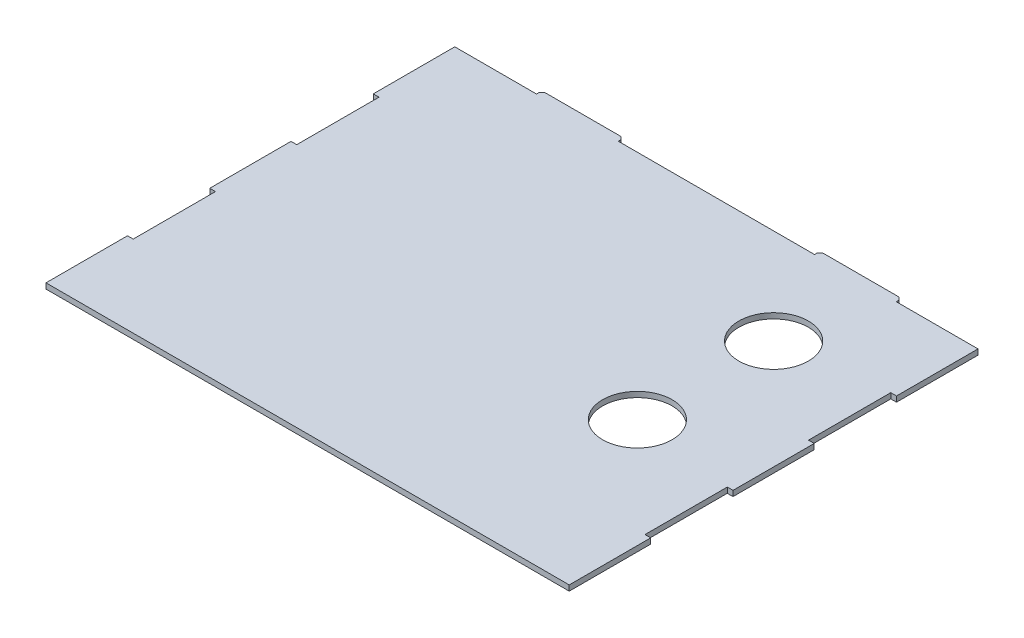
ISO-10303-21;
HEADER;
FILE_DESCRIPTION(('STEP AP214'),'2;1');
FILE_NAME('part.step','',(''),(''),'','','');
FILE_SCHEMA(('AUTOMOTIVE_DESIGN { 1 0 10303 214 1 1 1 1 }'));
ENDSEC;
DATA;
#1=APPLICATION_CONTEXT('core data for automotive mechanical design processes');
#2=APPLICATION_PROTOCOL_DEFINITION('international standard','automotive_design',2000,#1);
#3=PRODUCT_CONTEXT('',#1,'mechanical');
#4=PRODUCT('Part','Part','',(#3));
#5=PRODUCT_RELATED_PRODUCT_CATEGORY('part','',(#4));
#6=PRODUCT_DEFINITION_FORMATION('','',#4);
#7=PRODUCT_DEFINITION_CONTEXT('part definition',#1,'design');
#8=PRODUCT_DEFINITION('design','',#6,#7);
#9=PRODUCT_DEFINITION_SHAPE('','',#8);
#10=(LENGTH_UNIT() NAMED_UNIT(*) SI_UNIT(.MILLI.,.METRE.));
#11=(NAMED_UNIT(*) PLANE_ANGLE_UNIT() SI_UNIT($,.RADIAN.));
#12=(NAMED_UNIT(*) SI_UNIT($,.STERADIAN.) SOLID_ANGLE_UNIT());
#13=UNCERTAINTY_MEASURE_WITH_UNIT(LENGTH_MEASURE(1.E-05),#10,'distance_accuracy_value','');
#14=(GEOMETRIC_REPRESENTATION_CONTEXT(3) GLOBAL_UNCERTAINTY_ASSIGNED_CONTEXT((#13)) GLOBAL_UNIT_ASSIGNED_CONTEXT((#10,
#11,#12)) REPRESENTATION_CONTEXT('',''));
#15=CARTESIAN_POINT('',(0.,0.,0.));
#16=DIRECTION('',(0.,0.,1.));
#17=DIRECTION('',(1.,0.,0.));
#18=AXIS2_PLACEMENT_3D('',#15,#16,#17);
#19=CARTESIAN_POINT('',(-96.,-2.,75.));
#20=DIRECTION('',(-1.,0.,0.));
#21=DIRECTION('',(0.,0.,1.));
#22=AXIS2_PLACEMENT_3D('',#19,#20,#21);
#23=PLANE('',#22);
#24=DIRECTION('',(0.,-1.,0.));
#25=VECTOR('',#24,1.);
#26=CARTESIAN_POINT('',(-96.,-2.00000000000001,-45.1000000000001));
#27=LINE('',#26,#25);
#28=CARTESIAN_POINT('',(-96.,0.,-45.1000000000001));
#29=VERTEX_POINT('',#28);
#30=CARTESIAN_POINT('',(-96.,-2.00000000000004,-45.1000000000001));
#31=VERTEX_POINT('',#30);
#32=EDGE_CURVE('E281',#29,#31,#27,.T.);
#33=ORIENTED_EDGE('',*,*,#32,.F.);
#34=DIRECTION('',(0.,0.,1.));
#35=VECTOR('',#34,1.);
#36=CARTESIAN_POINT('',(-96.,0.,75.));
#37=LINE('',#36,#35);
#38=CARTESIAN_POINT('',(-96.,0.,-75.));
#39=VERTEX_POINT('',#38);
#40=EDGE_CURVE('E559',#39,#29,#37,.T.);
#41=ORIENTED_EDGE('',*,*,#40,.F.);
#42=DIRECTION('',(0.,1.,0.));
#43=VECTOR('',#42,1.);
#44=CARTESIAN_POINT('',(-96.,-2.,-75.));
#45=LINE('',#44,#43);
#46=CARTESIAN_POINT('',(-96.,-2.,-75.));
#47=VERTEX_POINT('',#46);
#48=EDGE_CURVE('E572',#47,#39,#45,.T.);
#49=ORIENTED_EDGE('',*,*,#48,.F.);
#50=DIRECTION('',(0.,0.,1.));
#51=VECTOR('',#50,1.);
#52=CARTESIAN_POINT('',(-96.,-2.,75.));
#53=LINE('',#52,#51);
#54=EDGE_CURVE('E542',#47,#31,#53,.T.);
#55=ORIENTED_EDGE('',*,*,#54,.T.);
#56=EDGE_LOOP('',(#33,#41,#49,#55));
#57=FACE_BOUND('',#56,.T.);
#58=ADVANCED_FACE('F68',(#57),#23,.T.);
#59=DIRECTION('',(0.,1.,0.));
#60=VECTOR('',#59,1.);
#61=CARTESIAN_POINT('',(-96.,-2.00000000000001,-14.9000000000001));
#62=LINE('',#61,#60);
#63=CARTESIAN_POINT('',(-96.,-2.00000000000004,-14.9));
#64=VERTEX_POINT('',#63);
#65=CARTESIAN_POINT('',(-96.,0.,-14.9000000000001));
#66=VERTEX_POINT('',#65);
#67=EDGE_CURVE('E91',#64,#66,#62,.T.);
#68=ORIENTED_EDGE('',*,*,#67,.F.);
#69=CARTESIAN_POINT('',(-96.,-2.00000000000004,14.9));
#70=VERTEX_POINT('',#69);
#71=EDGE_CURVE('E545',#64,#70,#53,.T.);
#72=ORIENTED_EDGE('',*,*,#71,.T.);
#73=DIRECTION('',(0.,-1.,0.));
#74=VECTOR('',#73,1.);
#75=CARTESIAN_POINT('',(-96.,-2.00000000000001,14.9));
#76=LINE('',#75,#74);
#77=CARTESIAN_POINT('',(-96.,0.,14.9));
#78=VERTEX_POINT('',#77);
#79=EDGE_CURVE('E341',#78,#70,#76,.T.);
#80=ORIENTED_EDGE('',*,*,#79,.F.);
#81=EDGE_CURVE('E563',#66,#78,#37,.T.);
#82=ORIENTED_EDGE('',*,*,#81,.F.);
#83=EDGE_LOOP('',(#68,#72,#80,#82));
#84=FACE_BOUND('',#83,.T.);
#85=ADVANCED_FACE('F597',(#84),#23,.T.);
#86=CARTESIAN_POINT('',(96.,-2.,75.));
#87=DIRECTION('',(1.,0.,0.));
#88=DIRECTION('',(0.,0.,-1.));
#89=AXIS2_PLACEMENT_3D('',#86,#87,#88);
#90=PLANE('',#89);
#91=DIRECTION('',(0.,-1.,0.));
#92=VECTOR('',#91,1.);
#93=CARTESIAN_POINT('',(96.,-2.,-14.9000000000001));
#94=LINE('',#93,#92);
#95=CARTESIAN_POINT('',(96.,0.,-14.9000000000001));
#96=VERTEX_POINT('',#95);
#97=CARTESIAN_POINT('',(96.,-2.00000000000003,-14.9000000000001));
#98=VERTEX_POINT('',#97);
#99=EDGE_CURVE('E413',#96,#98,#94,.T.);
#100=ORIENTED_EDGE('',*,*,#99,.F.);
#101=DIRECTION('',(0.,0.,-1.));
#102=VECTOR('',#101,1.);
#103=CARTESIAN_POINT('',(96.,0.,75.));
#104=LINE('',#103,#102);
#105=CARTESIAN_POINT('',(96.,0.,14.8999999999999));
#106=VERTEX_POINT('',#105);
#107=EDGE_CURVE('E553',#106,#96,#104,.T.);
#108=ORIENTED_EDGE('',*,*,#107,.F.);
#109=DIRECTION('',(0.,1.,0.));
#110=VECTOR('',#109,1.);
#111=CARTESIAN_POINT('',(96.,-2.,14.8999999999999));
#112=LINE('',#111,#110);
#113=CARTESIAN_POINT('',(96.,-2.00000000000003,14.8999999999999));
#114=VERTEX_POINT('',#113);
#115=EDGE_CURVE('E378',#114,#106,#112,.T.);
#116=ORIENTED_EDGE('',*,*,#115,.F.);
#117=DIRECTION('',(0.,0.,-1.));
#118=VECTOR('',#117,1.);
#119=CARTESIAN_POINT('',(96.,-2.,75.));
#120=LINE('',#119,#118);
#121=EDGE_CURVE('E536',#114,#98,#120,.T.);
#122=ORIENTED_EDGE('',*,*,#121,.T.);
#123=EDGE_LOOP('',(#100,#108,#116,#122));
#124=FACE_BOUND('',#123,.T.);
#125=ADVANCED_FACE('F619',(#124),#90,.T.);
#126=DIRECTION('',(0.,-1.,0.));
#127=VECTOR('',#126,1.);
#128=CARTESIAN_POINT('',(96.,-2.,45.0999999999999));
#129=LINE('',#128,#127);
#130=CARTESIAN_POINT('',(96.,0.,45.0999999999999));
#131=VERTEX_POINT('',#130);
#132=CARTESIAN_POINT('',(96.,-2.00000000000003,45.0999999999999));
#133=VERTEX_POINT('',#132);
#134=EDGE_CURVE('E409',#131,#133,#129,.T.);
#135=ORIENTED_EDGE('',*,*,#134,.F.);
#136=CARTESIAN_POINT('',(96.,0.,75.));
#137=VERTEX_POINT('',#136);
#138=EDGE_CURVE('E549',#137,#131,#104,.T.);
#139=ORIENTED_EDGE('',*,*,#138,.F.);
#140=DIRECTION('',(0.,1.,0.));
#141=VECTOR('',#140,1.);
#142=CARTESIAN_POINT('',(96.,-2.,75.));
#143=LINE('',#142,#141);
#144=CARTESIAN_POINT('',(96.,-2.,75.));
#145=VERTEX_POINT('',#144);
#146=EDGE_CURVE('E566',#145,#137,#143,.T.);
#147=ORIENTED_EDGE('',*,*,#146,.F.);
#148=EDGE_CURVE('E532',#145,#133,#120,.T.);
#149=ORIENTED_EDGE('',*,*,#148,.T.);
#150=EDGE_LOOP('',(#135,#139,#147,#149));
#151=FACE_BOUND('',#150,.T.);
#152=ADVANCED_FACE('F636',(#151),#90,.T.);
#153=CARTESIAN_POINT('',(-96.,-2.,-75.));
#154=DIRECTION('',(0.,0.,-1.));
#155=DIRECTION('',(-1.,0.,0.));
#156=AXIS2_PLACEMENT_3D('',#153,#154,#155);
#157=PLANE('',#156);
#158=CARTESIAN_POINT('',(-36.,0.,-75.));
#159=CARTESIAN_POINT('',(-36.,-2.,-75.));
#160=B_SPLINE_CURVE_WITH_KNOTS('',1,(#158,#159),.UNSPECIFIED.,.F.,.F.,(2,2),(0.,0.03125),.UNSPECIFIED.);
#161=CARTESIAN_POINT('',(-36.,0.,-75.));
#162=VERTEX_POINT('',#161);
#163=CARTESIAN_POINT('',(-36.,-2.,-75.));
#164=VERTEX_POINT('',#163);
#165=EDGE_CURVE('E423',#162,#164,#160,.T.);
#166=ORIENTED_EDGE('',*,*,#165,.F.);
#167=DIRECTION('',(-1.,0.,0.));
#168=VECTOR('',#167,1.);
#169=CARTESIAN_POINT('',(-96.,0.,-75.));
#170=LINE('',#169,#168);
#171=CARTESIAN_POINT('',(36.,0.,-75.));
#172=VERTEX_POINT('',#171);
#173=EDGE_CURVE('E558',#172,#162,#170,.T.);
#174=ORIENTED_EDGE('',*,*,#173,.F.);
#175=CARTESIAN_POINT('',(36.,-2.,-75.));
#176=CARTESIAN_POINT('',(36.,0.,-75.));
#177=B_SPLINE_CURVE_WITH_KNOTS('',1,(#175,#176),.UNSPECIFIED.,.F.,.F.,(2,2),(0.5,0.53125),.UNSPECIFIED.);
#178=CARTESIAN_POINT('',(36.,-2.,-75.));
#179=VERTEX_POINT('',#178);
#180=EDGE_CURVE('E468',#179,#172,#177,.T.);
#181=ORIENTED_EDGE('',*,*,#180,.F.);
#182=DIRECTION('',(-1.,0.,0.));
#183=VECTOR('',#182,1.);
#184=CARTESIAN_POINT('',(-96.,-2.,-75.));
#185=LINE('',#184,#183);
#186=EDGE_CURVE('E541',#179,#164,#185,.T.);
#187=ORIENTED_EDGE('',*,*,#186,.T.);
#188=EDGE_LOOP('',(#166,#174,#181,#187));
#189=FACE_BOUND('',#188,.T.);
#190=ADVANCED_FACE('F629',(#189),#157,.T.);
#191=CARTESIAN_POINT('',(66.,0.,-75.));
#192=CARTESIAN_POINT('',(66.,-2.,-75.));
#193=B_SPLINE_CURVE_WITH_KNOTS('',1,(#191,#192),.UNSPECIFIED.,.F.,.F.,(2,2),(0.,0.03125),.UNSPECIFIED.);
#194=CARTESIAN_POINT('',(66.,0.,-75.));
#195=VERTEX_POINT('',#194);
#196=CARTESIAN_POINT('',(66.,-2.,-75.));
#197=VERTEX_POINT('',#196);
#198=EDGE_CURVE('E475',#195,#197,#193,.T.);
#199=ORIENTED_EDGE('',*,*,#198,.F.);
#200=CARTESIAN_POINT('',(96.,0.,-75.));
#201=VERTEX_POINT('',#200);
#202=EDGE_CURVE('E554',#201,#195,#170,.T.);
#203=ORIENTED_EDGE('',*,*,#202,.F.);
#204=DIRECTION('',(0.,1.,0.));
#205=VECTOR('',#204,1.);
#206=CARTESIAN_POINT('',(96.,-2.,-75.));
#207=LINE('',#206,#205);
#208=CARTESIAN_POINT('',(96.,-2.,-75.));
#209=VERTEX_POINT('',#208);
#210=EDGE_CURVE('E548',#209,#201,#207,.T.);
#211=ORIENTED_EDGE('',*,*,#210,.F.);
#212=EDGE_CURVE('E538',#209,#197,#185,.T.);
#213=ORIENTED_EDGE('',*,*,#212,.T.);
#214=EDGE_LOOP('',(#199,#203,#211,#213));
#215=FACE_BOUND('',#214,.T.);
#216=ADVANCED_FACE('F630',(#215),#157,.T.);
#217=DIRECTION('',(0.,1.,0.));
#218=VECTOR('',#217,1.);
#219=CARTESIAN_POINT('',(96.,-2.,-45.1000000000001));
#220=LINE('',#219,#218);
#221=CARTESIAN_POINT('',(96.,-2.00000000000003,-45.1000000000001));
#222=VERTEX_POINT('',#221);
#223=CARTESIAN_POINT('',(96.,0.,-45.1000000000001));
#224=VERTEX_POINT('',#223);
#225=EDGE_CURVE('E411',#222,#224,#220,.T.);
#226=ORIENTED_EDGE('',*,*,#225,.F.);
#227=EDGE_CURVE('E537',#222,#209,#120,.T.);
#228=ORIENTED_EDGE('',*,*,#227,.T.);
#229=ORIENTED_EDGE('',*,*,#210,.T.);
#230=EDGE_CURVE('E531',#224,#201,#104,.T.);
#231=ORIENTED_EDGE('',*,*,#230,.F.);
#232=EDGE_LOOP('',(#226,#228,#229,#231));
#233=FACE_BOUND('',#232,.T.);
#234=ADVANCED_FACE('F70',(#233),#90,.T.);
#235=CARTESIAN_POINT('',(-96.,-2.,75.));
#236=DIRECTION('',(0.,0.,1.));
#237=DIRECTION('',(1.,0.,0.));
#238=AXIS2_PLACEMENT_3D('',#235,#236,#237);
#239=PLANE('',#238);
#240=DIRECTION('',(1.,0.,0.));
#241=VECTOR('',#240,1.);
#242=CARTESIAN_POINT('',(-96.,0.,75.));
#243=LINE('',#242,#241);
#244=CARTESIAN_POINT('',(-96.,0.,75.));
#245=VERTEX_POINT('',#244);
#246=EDGE_CURVE('E562',#245,#137,#243,.T.);
#247=ORIENTED_EDGE('',*,*,#246,.F.);
#248=DIRECTION('',(0.,1.,0.));
#249=VECTOR('',#248,1.);
#250=CARTESIAN_POINT('',(-96.,-2.,75.));
#251=LINE('',#250,#249);
#252=CARTESIAN_POINT('',(-96.,-2.,75.));
#253=VERTEX_POINT('',#252);
#254=EDGE_CURVE('E569',#253,#245,#251,.T.);
#255=ORIENTED_EDGE('',*,*,#254,.F.);
#256=DIRECTION('',(1.,0.,0.));
#257=VECTOR('',#256,1.);
#258=CARTESIAN_POINT('',(-96.,-2.,75.));
#259=LINE('',#258,#257);
#260=EDGE_CURVE('E544',#253,#145,#259,.T.);
#261=ORIENTED_EDGE('',*,*,#260,.T.);
#262=ORIENTED_EDGE('',*,*,#146,.T.);
#263=EDGE_LOOP('',(#247,#255,#261,#262));
#264=FACE_BOUND('',#263,.T.);
#265=ADVANCED_FACE('F623',(#264),#239,.T.);
#266=DIRECTION('',(0.,1.,0.));
#267=VECTOR('',#266,1.);
#268=CARTESIAN_POINT('',(-96.,-2.,45.1));
#269=LINE('',#268,#267);
#270=CARTESIAN_POINT('',(-96.,-2.00000000000004,45.1));
#271=VERTEX_POINT('',#270);
#272=CARTESIAN_POINT('',(-96.,0.,45.1));
#273=VERTEX_POINT('',#272);
#274=EDGE_CURVE('E83',#271,#273,#269,.T.);
#275=ORIENTED_EDGE('',*,*,#274,.F.);
#276=EDGE_CURVE('E540',#271,#253,#53,.T.);
#277=ORIENTED_EDGE('',*,*,#276,.T.);
#278=ORIENTED_EDGE('',*,*,#254,.T.);
#279=EDGE_CURVE('E557',#273,#245,#37,.T.);
#280=ORIENTED_EDGE('',*,*,#279,.F.);
#281=EDGE_LOOP('',(#275,#277,#278,#280));
#282=FACE_BOUND('',#281,.T.);
#283=ADVANCED_FACE('F589',(#282),#23,.T.);
#284=CARTESIAN_POINT('',(-66.,-2.,-75.));
#285=CARTESIAN_POINT('',(-66.,0.,-75.));
#286=B_SPLINE_CURVE_WITH_KNOTS('',1,(#284,#285),.UNSPECIFIED.,.F.,.F.,(2,2),(0.5,0.53125),.UNSPECIFIED.);
#287=CARTESIAN_POINT('',(-66.,-2.,-75.));
#288=VERTEX_POINT('',#287);
#289=CARTESIAN_POINT('',(-66.,0.,-75.));
#290=VERTEX_POINT('',#289);
#291=EDGE_CURVE('E416',#288,#290,#286,.T.);
#292=ORIENTED_EDGE('',*,*,#291,.F.);
#293=EDGE_CURVE('E535',#288,#47,#185,.T.);
#294=ORIENTED_EDGE('',*,*,#293,.T.);
#295=ORIENTED_EDGE('',*,*,#48,.T.);
#296=EDGE_CURVE('E552',#290,#39,#170,.T.);
#297=ORIENTED_EDGE('',*,*,#296,.F.);
#298=EDGE_LOOP('',(#292,#294,#295,#297));
#299=FACE_BOUND('',#298,.T.);
#300=ADVANCED_FACE('F622',(#299),#157,.T.);
#301=CARTESIAN_POINT('',(0.,-2.,0.));
#302=DIRECTION('',(0.,-1.,0.));
#303=DIRECTION('',(0.,0.,-1.));
#304=AXIS2_PLACEMENT_3D('',#301,#302,#303);
#305=PLANE('',#304);
#306=DIRECTION('',(-1.,0.,0.));
#307=VECTOR('',#306,1.);
#308=CARTESIAN_POINT('',(-93.9000000000001,-2.00000000000004,-45.1000000000001));
#309=LINE('',#308,#307);
#310=CARTESIAN_POINT('',(-93.9000000000001,-2.00000000000004,-45.1000000000001));
#311=VERTEX_POINT('',#310);
#312=EDGE_CURVE('E275',#311,#31,#309,.T.);
#313=ORIENTED_EDGE('',*,*,#312,.T.);
#314=ORIENTED_EDGE('',*,*,#54,.F.);
#315=ORIENTED_EDGE('',*,*,#293,.F.);
#316=DIRECTION('',(0.,0.,1.));
#317=VECTOR('',#316,1.);
#318=CARTESIAN_POINT('',(-66.,-2.,-79.0000000000002));
#319=LINE('',#318,#317);
#320=CARTESIAN_POINT('',(-66.,-2.,-76.0000000000001));
#321=VERTEX_POINT('',#320);
#322=EDGE_CURVE('E422',#321,#288,#319,.T.);
#323=ORIENTED_EDGE('',*,*,#322,.F.);
#324=DIRECTION('',(0.707106781186548,0.,-0.707106781186548));
#325=VECTOR('',#324,1.);
#326=CARTESIAN_POINT('',(-65.,-2.,-77.0000000000001));
#327=LINE('',#326,#325);
#328=CARTESIAN_POINT('',(-65.,-2.,-77.0000000000001));
#329=VERTEX_POINT('',#328);
#330=EDGE_CURVE('E463',#321,#329,#327,.T.);
#331=ORIENTED_EDGE('',*,*,#330,.T.);
#332=DIRECTION('',(-1.,0.,0.));
#333=VECTOR('',#332,1.);
#334=CARTESIAN_POINT('',(-36.,-2.,-77.0000000000001));
#335=LINE('',#334,#333);
#336=CARTESIAN_POINT('',(-37.,-2.,-77.0000000000001));
#337=VERTEX_POINT('',#336);
#338=EDGE_CURVE('E432',#337,#329,#335,.T.);
#339=ORIENTED_EDGE('',*,*,#338,.F.);
#340=DIRECTION('',(0.707106781186548,0.,0.707106781186548));
#341=VECTOR('',#340,1.);
#342=CARTESIAN_POINT('',(-37.,-2.,-77.0000000000001));
#343=LINE('',#342,#341);
#344=CARTESIAN_POINT('',(-36.,-2.,-76.0000000000001));
#345=VERTEX_POINT('',#344);
#346=EDGE_CURVE('E461',#337,#345,#343,.T.);
#347=ORIENTED_EDGE('',*,*,#346,.T.);
#348=DIRECTION('',(0.,0.,1.));
#349=VECTOR('',#348,1.);
#350=CARTESIAN_POINT('',(-36.,-2.,-79.0000000000002));
#351=LINE('',#350,#349);
#352=EDGE_CURVE('E431',#345,#164,#351,.T.);
#353=ORIENTED_EDGE('',*,*,#352,.T.);
#354=ORIENTED_EDGE('',*,*,#186,.F.);
#355=DIRECTION('',(0.,0.,1.));
#356=VECTOR('',#355,1.);
#357=CARTESIAN_POINT('',(36.,-2.,-79.0000000000002));
#358=LINE('',#357,#356);
#359=CARTESIAN_POINT('',(36.,-2.,-76.0000000000001));
#360=VERTEX_POINT('',#359);
#361=EDGE_CURVE('E474',#360,#179,#358,.T.);
#362=ORIENTED_EDGE('',*,*,#361,.F.);
#363=DIRECTION('',(0.707106781186548,0.,-0.707106781186548));
#364=VECTOR('',#363,1.);
#365=CARTESIAN_POINT('',(37.,-2.,-77.0000000000001));
#366=LINE('',#365,#364);
#367=CARTESIAN_POINT('',(37.,-2.,-77.0000000000001));
#368=VERTEX_POINT('',#367);
#369=EDGE_CURVE('E515',#360,#368,#366,.T.);
#370=ORIENTED_EDGE('',*,*,#369,.T.);
#371=DIRECTION('',(-1.,0.,0.));
#372=VECTOR('',#371,1.);
#373=CARTESIAN_POINT('',(66.,-2.,-77.0000000000001));
#374=LINE('',#373,#372);
#375=CARTESIAN_POINT('',(65.,-2.,-77.0000000000001));
#376=VERTEX_POINT('',#375);
#377=EDGE_CURVE('E484',#376,#368,#374,.T.);
#378=ORIENTED_EDGE('',*,*,#377,.F.);
#379=DIRECTION('',(0.707106781186548,0.,0.707106781186548));
#380=VECTOR('',#379,1.);
#381=CARTESIAN_POINT('',(65.,-2.,-77.0000000000001));
#382=LINE('',#381,#380);
#383=CARTESIAN_POINT('',(66.,-2.,-76.0000000000001));
#384=VERTEX_POINT('',#383);
#385=EDGE_CURVE('E513',#376,#384,#382,.T.);
#386=ORIENTED_EDGE('',*,*,#385,.T.);
#387=DIRECTION('',(0.,0.,1.));
#388=VECTOR('',#387,1.);
#389=CARTESIAN_POINT('',(66.,-2.,-79.0000000000002));
#390=LINE('',#389,#388);
#391=EDGE_CURVE('E483',#384,#197,#390,.T.);
#392=ORIENTED_EDGE('',*,*,#391,.T.);
#393=ORIENTED_EDGE('',*,*,#212,.F.);
#394=ORIENTED_EDGE('',*,*,#227,.F.);
#395=CARTESIAN_POINT('',(93.8999999999999,-2.00000000000003,-45.1000000000001));
#396=CARTESIAN_POINT('',(96.1,-2.00000000000003,-45.1000000000001));
#397=B_SPLINE_CURVE_WITH_KNOTS('',1,(#395,#396),.UNSPECIFIED.,.F.,.F.,(2,2),(0.5,
0.533950617283951),.UNSPECIFIED.);
#398=CARTESIAN_POINT('',(93.8999999999999,-2.00000000000003,-45.1000000000001));
#399=VERTEX_POINT('',#398);
#400=EDGE_CURVE('E363',#399,#222,#397,.T.);
#401=ORIENTED_EDGE('',*,*,#400,.F.);
#402=CARTESIAN_POINT('',(93.8999999999999,-2.00000000000003,-14.9000000000001));
#403=CARTESIAN_POINT('',(93.8999999999999,-2.00000000000003,-45.1000000000001));
#404=B_SPLINE_CURVE_WITH_KNOTS('',1,(#402,#403),.UNSPECIFIED.,.F.,.F.,(2,2),(0.0339506172839506,
0.5),.UNSPECIFIED.);
#405=CARTESIAN_POINT('',(93.8999999999999,-2.00000000000003,-14.9000000000001));
#406=VERTEX_POINT('',#405);
#407=EDGE_CURVE('E354',#406,#399,#404,.T.);
#408=ORIENTED_EDGE('',*,*,#407,.F.);
#409=CARTESIAN_POINT('',(96.1,-2.00000000000003,-14.9000000000001));
#410=CARTESIAN_POINT('',(93.8999999999999,-2.00000000000003,-14.9000000000001));
#411=B_SPLINE_CURVE_WITH_KNOTS('',1,(#409,#410),.UNSPECIFIED.,.F.,.F.,(2,2),(0.,
0.0339506172839506),.UNSPECIFIED.);
#412=EDGE_CURVE('E350',#98,#406,#411,.T.);
#413=ORIENTED_EDGE('',*,*,#412,.F.);
#414=ORIENTED_EDGE('',*,*,#121,.F.);
#415=CARTESIAN_POINT('',(93.8999999999999,-2.00000000000003,14.8999999999999));
#416=CARTESIAN_POINT('',(96.1,-2.00000000000003,14.8999999999999));
#417=B_SPLINE_CURVE_WITH_KNOTS('',1,(#415,#416),.UNSPECIFIED.,.F.,.F.,(2,2),(0.5,
0.533950617283951),.UNSPECIFIED.);
#418=CARTESIAN_POINT('',(93.8999999999999,-2.00000000000003,14.8999999999999));
#419=VERTEX_POINT('',#418);
#420=EDGE_CURVE('E393',#419,#114,#417,.T.);
#421=ORIENTED_EDGE('',*,*,#420,.F.);
#422=CARTESIAN_POINT('',(93.8999999999999,-2.00000000000003,45.0999999999999));
#423=CARTESIAN_POINT('',(93.8999999999999,-2.00000000000003,14.8999999999999));
#424=B_SPLINE_CURVE_WITH_KNOTS('',1,(#422,#423),.UNSPECIFIED.,.F.,.F.,(2,2),(0.0339506172839506,
0.5),.UNSPECIFIED.);
#425=CARTESIAN_POINT('',(93.8999999999999,-2.00000000000003,45.0999999999999));
#426=VERTEX_POINT('',#425);
#427=EDGE_CURVE('E385',#426,#419,#424,.T.);
#428=ORIENTED_EDGE('',*,*,#427,.F.);
#429=CARTESIAN_POINT('',(96.1,-2.00000000000003,45.0999999999999));
#430=CARTESIAN_POINT('',(93.8999999999999,-2.00000000000003,45.0999999999999));
#431=B_SPLINE_CURVE_WITH_KNOTS('',1,(#429,#430),.UNSPECIFIED.,.F.,.F.,(2,2),(0.,
0.0339506172839506),.UNSPECIFIED.);
#432=EDGE_CURVE('E345',#133,#426,#431,.T.);
#433=ORIENTED_EDGE('',*,*,#432,.F.);
#434=ORIENTED_EDGE('',*,*,#148,.F.);
#435=ORIENTED_EDGE('',*,*,#260,.F.);
#436=ORIENTED_EDGE('',*,*,#276,.F.);
#437=DIRECTION('',(1.,0.,0.));
#438=VECTOR('',#437,1.);
#439=CARTESIAN_POINT('',(-96.1000000000001,-2.00000000000004,45.1));
#440=LINE('',#439,#438);
#441=CARTESIAN_POINT('',(-93.9000000000001,-2.00000000000004,45.1));
#442=VERTEX_POINT('',#441);
#443=EDGE_CURVE('E330',#271,#442,#440,.T.);
#444=ORIENTED_EDGE('',*,*,#443,.T.);
#445=DIRECTION('',(0.,0.,-1.));
#446=VECTOR('',#445,1.);
#447=CARTESIAN_POINT('',(-93.9000000000001,-2.00000000000004,45.1));
#448=LINE('',#447,#446);
#449=CARTESIAN_POINT('',(-93.9000000000001,-2.00000000000005,14.9));
#450=VERTEX_POINT('',#449);
#451=EDGE_CURVE('E315',#442,#450,#448,.T.);
#452=ORIENTED_EDGE('',*,*,#451,.T.);
#453=DIRECTION('',(-1.,0.,0.));
#454=VECTOR('',#453,1.);
#455=CARTESIAN_POINT('',(-93.9000000000001,-2.00000000000004,14.9));
#456=LINE('',#455,#454);
#457=EDGE_CURVE('E334',#450,#70,#456,.T.);
#458=ORIENTED_EDGE('',*,*,#457,.T.);
#459=ORIENTED_EDGE('',*,*,#71,.F.);
#460=DIRECTION('',(1.,0.,0.));
#461=VECTOR('',#460,1.);
#462=CARTESIAN_POINT('',(-96.1000000000001,-2.00000000000004,-14.9));
#463=LINE('',#462,#461);
#464=CARTESIAN_POINT('',(-93.9000000000001,-2.00000000000004,-14.9));
#465=VERTEX_POINT('',#464);
#466=EDGE_CURVE('E286',#64,#465,#463,.T.);
#467=ORIENTED_EDGE('',*,*,#466,.T.);
#468=DIRECTION('',(0.,0.,-1.));
#469=VECTOR('',#468,1.);
#470=CARTESIAN_POINT('',(-93.9000000000001,-2.00000000000004,-14.9));
#471=LINE('',#470,#469);
#472=EDGE_CURVE('E291',#465,#311,#471,.T.);
#473=ORIENTED_EDGE('',*,*,#472,.T.);
#474=EDGE_LOOP('',(#313,#314,#315,#323,#331,#339,#347,#353,#354,#362,#370,#378,#386,#392,#393,
#394,#401,#408,#413,#414,#421,#428,#433,#434,#435,#436,#444,#452,#458,#459,#467,#473));
#475=FACE_BOUND('',#474,.T.);
#476=CARTESIAN_POINT('',(56.,-2.,9.99999999999999));
#477=DIRECTION('',(0.,-1.,0.));
#478=DIRECTION('',(0.,0.,-1.));
#479=AXIS2_PLACEMENT_3D('',#476,#477,#478);
#480=CIRCLE('',#479,12.75);
#481=CARTESIAN_POINT('',(56.,-2.,-2.75000000000001));
#482=VERTEX_POINT('',#481);
#483=EDGE_CURVE('E522',#482,#482,#480,.T.);
#484=ORIENTED_EDGE('',*,*,#483,.F.);
#485=EDGE_LOOP('',(#484));
#486=FACE_BOUND('',#485,.T.);
#487=CARTESIAN_POINT('',(56.,-2.,-40.));
#488=DIRECTION('',(0.,-1.,0.));
#489=DIRECTION('',(0.,0.,-1.));
#490=AXIS2_PLACEMENT_3D('',#487,#488,#489);
#491=CIRCLE('',#490,12.75);
#492=CARTESIAN_POINT('',(56.,-2.,-52.75));
#493=VERTEX_POINT('',#492);
#494=EDGE_CURVE('E528',#493,#493,#491,.T.);
#495=ORIENTED_EDGE('',*,*,#494,.F.);
#496=EDGE_LOOP('',(#495));
#497=FACE_BOUND('',#496,.T.);
#498=ADVANCED_FACE('F298',(#475,#486,#497),#305,.T.);
#499=CARTESIAN_POINT('',(0.,0.,0.));
#500=DIRECTION('',(0.,-1.,0.));
#501=DIRECTION('',(0.,0.,-1.));
#502=AXIS2_PLACEMENT_3D('',#499,#500,#501);
#503=PLANE('',#502);
#504=ORIENTED_EDGE('',*,*,#40,.T.);
#505=CARTESIAN_POINT('',(-93.9000000000001,0.,-45.1000000000001));
#506=CARTESIAN_POINT('',(-96.1000000000001,0.,-45.1000000000001));
#507=B_SPLINE_CURVE_WITH_KNOTS('',1,(#505,#506),.UNSPECIFIED.,.F.,.F.,(2,2),(0.5,
0.533950617283951),.UNSPECIFIED.);
#508=CARTESIAN_POINT('',(-93.9000000000001,0.,-45.1000000000001));
#509=VERTEX_POINT('',#508);
#510=EDGE_CURVE('E301',#509,#29,#507,.T.);
#511=ORIENTED_EDGE('',*,*,#510,.F.);
#512=CARTESIAN_POINT('',(-93.9000000000001,0.,-14.9000000000001));
#513=CARTESIAN_POINT('',(-93.9000000000001,0.,-45.1000000000001));
#514=B_SPLINE_CURVE_WITH_KNOTS('',1,(#512,#513),.UNSPECIFIED.,.F.,.F.,(2,2),(0.0339506172839506,
0.5),.UNSPECIFIED.);
#515=CARTESIAN_POINT('',(-93.9000000000001,0.,-14.9000000000001));
#516=VERTEX_POINT('',#515);
#517=EDGE_CURVE('E294',#516,#509,#514,.T.);
#518=ORIENTED_EDGE('',*,*,#517,.F.);
#519=DIRECTION('',(-1.,0.,0.));
#520=VECTOR('',#519,1.);
#521=CARTESIAN_POINT('',(0.,0.,-14.9));
#522=LINE('',#521,#520);
#523=EDGE_CURVE('E13',#516,#66,#522,.T.);
#524=ORIENTED_EDGE('',*,*,#523,.T.);
#525=ORIENTED_EDGE('',*,*,#81,.T.);
#526=CARTESIAN_POINT('',(-93.9000000000001,0.,14.9));
#527=CARTESIAN_POINT('',(-96.1000000000001,0.,14.9));
#528=B_SPLINE_CURVE_WITH_KNOTS('',1,(#526,#527),.UNSPECIFIED.,.F.,.F.,(2,2),(0.5,
0.533950617283951),.UNSPECIFIED.);
#529=CARTESIAN_POINT('',(-93.9000000000001,0.,14.9));
#530=VERTEX_POINT('',#529);
#531=EDGE_CURVE('E311',#530,#78,#528,.T.);
#532=ORIENTED_EDGE('',*,*,#531,.F.);
#533=CARTESIAN_POINT('',(-93.9000000000001,0.,45.1));
#534=CARTESIAN_POINT('',(-93.9000000000001,0.,14.9));
#535=B_SPLINE_CURVE_WITH_KNOTS('',1,(#533,#534),.UNSPECIFIED.,.F.,.F.,(2,2),(0.0339506172839506,
0.5),.UNSPECIFIED.);
#536=CARTESIAN_POINT('',(-93.9000000000001,0.,45.1));
#537=VERTEX_POINT('',#536);
#538=EDGE_CURVE('E316',#537,#530,#535,.T.);
#539=ORIENTED_EDGE('',*,*,#538,.F.);
#540=DIRECTION('',(-1.,0.,0.));
#541=VECTOR('',#540,1.);
#542=CARTESIAN_POINT('',(0.,0.,45.1));
#543=LINE('',#542,#541);
#544=EDGE_CURVE('E76',#537,#273,#543,.T.);
#545=ORIENTED_EDGE('',*,*,#544,.T.);
#546=ORIENTED_EDGE('',*,*,#279,.T.);
#547=ORIENTED_EDGE('',*,*,#246,.T.);
#548=ORIENTED_EDGE('',*,*,#138,.T.);
#549=DIRECTION('',(1.,0.,0.));
#550=VECTOR('',#549,1.);
#551=CARTESIAN_POINT('',(96.1,0.,45.0999999999999));
#552=LINE('',#551,#550);
#553=CARTESIAN_POINT('',(93.8999999999999,0.,45.0999999999999));
#554=VERTEX_POINT('',#553);
#555=EDGE_CURVE('E379',#554,#131,#552,.T.);
#556=ORIENTED_EDGE('',*,*,#555,.F.);
#557=DIRECTION('',(0.,0.,1.));
#558=VECTOR('',#557,1.);
#559=CARTESIAN_POINT('',(93.8999999999999,0.,45.0999999999999));
#560=LINE('',#559,#558);
#561=CARTESIAN_POINT('',(93.8999999999999,0.,14.8999999999999));
#562=VERTEX_POINT('',#561);
#563=EDGE_CURVE('E355',#562,#554,#560,.T.);
#564=ORIENTED_EDGE('',*,*,#563,.F.);
#565=DIRECTION('',(1.,0.,0.));
#566=VECTOR('',#565,1.);
#567=CARTESIAN_POINT('',(0.,0.,14.8999999999999));
#568=LINE('',#567,#566);
#569=EDGE_CURVE('E568',#562,#106,#568,.T.);
#570=ORIENTED_EDGE('',*,*,#569,.T.);
#571=ORIENTED_EDGE('',*,*,#107,.T.);
#572=DIRECTION('',(1.,0.,0.));
#573=VECTOR('',#572,1.);
#574=CARTESIAN_POINT('',(96.1,0.,-14.9000000000001));
#575=LINE('',#574,#573);
#576=CARTESIAN_POINT('',(93.8999999999999,0.,-14.9000000000001));
#577=VERTEX_POINT('',#576);
#578=EDGE_CURVE('E346',#577,#96,#575,.T.);
#579=ORIENTED_EDGE('',*,*,#578,.F.);
#580=DIRECTION('',(0.,0.,1.));
#581=VECTOR('',#580,1.);
#582=CARTESIAN_POINT('',(93.8999999999999,0.,-14.9000000000001));
#583=LINE('',#582,#581);
#584=CARTESIAN_POINT('',(93.8999999999999,0.,-45.1000000000001));
#585=VERTEX_POINT('',#584);
#586=EDGE_CURVE('E348',#585,#577,#583,.T.);
#587=ORIENTED_EDGE('',*,*,#586,.F.);
#588=DIRECTION('',(1.,0.,0.));
#589=VECTOR('',#588,1.);
#590=CARTESIAN_POINT('',(0.,0.,-45.1000000000001));
#591=LINE('',#590,#589);
#592=EDGE_CURVE('E579',#585,#224,#591,.T.);
#593=ORIENTED_EDGE('',*,*,#592,.T.);
#594=ORIENTED_EDGE('',*,*,#230,.T.);
#595=ORIENTED_EDGE('',*,*,#202,.T.);
#596=DIRECTION('',(0.,0.,1.));
#597=VECTOR('',#596,1.);
#598=CARTESIAN_POINT('',(66.,0.,-79.0000000000002));
#599=LINE('',#598,#597);
#600=CARTESIAN_POINT('',(66.,0.,-76.0000000000001));
#601=VERTEX_POINT('',#600);
#602=EDGE_CURVE('E467',#601,#195,#599,.T.);
#603=ORIENTED_EDGE('',*,*,#602,.F.);
#604=DIRECTION('',(-0.707106781186548,0.,-0.707106781186548));
#605=VECTOR('',#604,1.);
#606=CARTESIAN_POINT('',(65.,0.,-77.0000000000001));
#607=LINE('',#606,#605);
#608=CARTESIAN_POINT('',(65.,0.,-77.0000000000001));
#609=VERTEX_POINT('',#608);
#610=EDGE_CURVE('E507',#601,#609,#607,.T.);
#611=ORIENTED_EDGE('',*,*,#610,.T.);
#612=DIRECTION('',(1.,0.,0.));
#613=VECTOR('',#612,1.);
#614=CARTESIAN_POINT('',(36.,0.,-77.0000000000001));
#615=LINE('',#614,#613);
#616=CARTESIAN_POINT('',(37.,0.,-77.0000000000001));
#617=VERTEX_POINT('',#616);
#618=EDGE_CURVE('E491',#617,#609,#615,.T.);
#619=ORIENTED_EDGE('',*,*,#618,.F.);
#620=DIRECTION('',(-0.707106781186548,0.,0.707106781186548));
#621=VECTOR('',#620,1.);
#622=CARTESIAN_POINT('',(37.,0.,-77.0000000000001));
#623=LINE('',#622,#621);
#624=CARTESIAN_POINT('',(36.,0.,-76.0000000000001));
#625=VERTEX_POINT('',#624);
#626=EDGE_CURVE('E509',#617,#625,#623,.T.);
#627=ORIENTED_EDGE('',*,*,#626,.T.);
#628=DIRECTION('',(0.,0.,1.));
#629=VECTOR('',#628,1.);
#630=CARTESIAN_POINT('',(36.,0.,-79.0000000000002));
#631=LINE('',#630,#629);
#632=EDGE_CURVE('E473',#625,#172,#631,.T.);
#633=ORIENTED_EDGE('',*,*,#632,.T.);
#634=ORIENTED_EDGE('',*,*,#173,.T.);
#635=DIRECTION('',(0.,0.,1.));
#636=VECTOR('',#635,1.);
#637=CARTESIAN_POINT('',(-36.,0.,-79.0000000000002));
#638=LINE('',#637,#636);
#639=CARTESIAN_POINT('',(-36.,0.,-76.0000000000001));
#640=VERTEX_POINT('',#639);
#641=EDGE_CURVE('E415',#640,#162,#638,.T.);
#642=ORIENTED_EDGE('',*,*,#641,.F.);
#643=DIRECTION('',(-0.707106781186548,0.,-0.707106781186548));
#644=VECTOR('',#643,1.);
#645=CARTESIAN_POINT('',(-37.,0.,-77.0000000000001));
#646=LINE('',#645,#644);
#647=CARTESIAN_POINT('',(-37.,0.,-77.0000000000001));
#648=VERTEX_POINT('',#647);
#649=EDGE_CURVE('E455',#640,#648,#646,.T.);
#650=ORIENTED_EDGE('',*,*,#649,.T.);
#651=DIRECTION('',(1.,0.,0.));
#652=VECTOR('',#651,1.);
#653=CARTESIAN_POINT('',(-66.,0.,-77.0000000000001));
#654=LINE('',#653,#652);
#655=CARTESIAN_POINT('',(-65.,0.,-77.0000000000001));
#656=VERTEX_POINT('',#655);
#657=EDGE_CURVE('E439',#656,#648,#654,.T.);
#658=ORIENTED_EDGE('',*,*,#657,.F.);
#659=DIRECTION('',(-0.707106781186548,0.,0.707106781186548));
#660=VECTOR('',#659,1.);
#661=CARTESIAN_POINT('',(-65.,0.,-77.0000000000001));
#662=LINE('',#661,#660);
#663=CARTESIAN_POINT('',(-66.,0.,-76.0000000000001));
#664=VERTEX_POINT('',#663);
#665=EDGE_CURVE('E457',#656,#664,#662,.T.);
#666=ORIENTED_EDGE('',*,*,#665,.T.);
#667=DIRECTION('',(0.,0.,1.));
#668=VECTOR('',#667,1.);
#669=CARTESIAN_POINT('',(-66.,0.,-79.0000000000002));
#670=LINE('',#669,#668);
#671=EDGE_CURVE('E421',#664,#290,#670,.T.);
#672=ORIENTED_EDGE('',*,*,#671,.T.);
#673=ORIENTED_EDGE('',*,*,#296,.T.);
#674=EDGE_LOOP('',(#504,#511,#518,#524,#525,#532,#539,#545,#546,#547,#548,#556,#564,#570,#571,
#579,#587,#593,#594,#595,#603,#611,#619,#627,#633,#634,#642,#650,#658,#666,#672,#673));
#675=FACE_BOUND('',#674,.T.);
#676=CARTESIAN_POINT('',(56.,0.,9.99999999999999));
#677=DIRECTION('',(0.,1.,0.));
#678=DIRECTION('',(0.,0.,1.));
#679=AXIS2_PLACEMENT_3D('',#676,#677,#678);
#680=CIRCLE('',#679,12.75);
#681=CARTESIAN_POINT('',(56.,0.,22.75));
#682=VERTEX_POINT('',#681);
#683=EDGE_CURVE('E519',#682,#682,#680,.T.);
#684=ORIENTED_EDGE('',*,*,#683,.F.);
#685=EDGE_LOOP('',(#684));
#686=FACE_BOUND('',#685,.T.);
#687=CARTESIAN_POINT('',(56.,0.,-40.));
#688=DIRECTION('',(0.,1.,0.));
#689=DIRECTION('',(0.,0.,1.));
#690=AXIS2_PLACEMENT_3D('',#687,#688,#689);
#691=CIRCLE('',#690,12.75);
#692=CARTESIAN_POINT('',(56.,0.,-27.25));
#693=VERTEX_POINT('',#692);
#694=EDGE_CURVE('E525',#693,#693,#691,.T.);
#695=ORIENTED_EDGE('',*,*,#694,.F.);
#696=EDGE_LOOP('',(#695));
#697=FACE_BOUND('',#696,.T.);
#698=ADVANCED_FACE('F584',(#675,#686,#697),#503,.F.);
#699=CARTESIAN_POINT('',(56.,0.,-40.));
#700=DIRECTION('',(0.,1.,0.));
#701=DIRECTION('',(0.,0.,1.));
#702=AXIS2_PLACEMENT_3D('',#699,#700,#701);
#703=CYLINDRICAL_SURFACE('',#702,12.75);
#704=ORIENTED_EDGE('',*,*,#694,.T.);
#705=EDGE_LOOP('',(#704));
#706=FACE_BOUND('',#705,.T.);
#707=ORIENTED_EDGE('',*,*,#494,.T.);
#708=EDGE_LOOP('',(#707));
#709=FACE_BOUND('',#708,.T.);
#710=ADVANCED_FACE('F640',(#706,#709),#703,.F.);
#711=CARTESIAN_POINT('',(56.,0.,9.99999999999999));
#712=DIRECTION('',(0.,1.,0.));
#713=DIRECTION('',(0.,0.,1.));
#714=AXIS2_PLACEMENT_3D('',#711,#712,#713);
#715=CYLINDRICAL_SURFACE('',#714,12.75);
#716=ORIENTED_EDGE('',*,*,#683,.T.);
#717=EDGE_LOOP('',(#716));
#718=FACE_BOUND('',#717,.T.);
#719=ORIENTED_EDGE('',*,*,#483,.T.);
#720=EDGE_LOOP('',(#719));
#721=FACE_BOUND('',#720,.T.);
#722=ADVANCED_FACE('F645',(#718,#721),#715,.F.);
#723=CARTESIAN_POINT('',(66.,0.,-79.0000000000002));
#724=DIRECTION('',(-1.,0.,0.));
#725=DIRECTION('',(0.,0.,1.));
#726=AXIS2_PLACEMENT_3D('',#723,#724,#725);
#727=PLANE('',#726);
#728=ORIENTED_EDGE('',*,*,#391,.F.);
#729=DIRECTION('',(0.,1.,0.));
#730=VECTOR('',#729,1.);
#731=CARTESIAN_POINT('',(66.,0.,-76.0000000000001));
#732=LINE('',#731,#730);
#733=EDGE_CURVE('E517',#384,#601,#732,.T.);
#734=ORIENTED_EDGE('',*,*,#733,.T.);
#735=ORIENTED_EDGE('',*,*,#602,.T.);
#736=ORIENTED_EDGE('',*,*,#198,.T.);
#737=EDGE_LOOP('',(#728,#734,#735,#736));
#738=FACE_BOUND('',#737,.T.);
#739=ADVANCED_FACE('F649',(#738),#727,.F.);
#740=CARTESIAN_POINT('',(36.,-2.,-79.0000000000002));
#741=DIRECTION('',(1.,0.,0.));
#742=DIRECTION('',(0.,0.,-1.));
#743=AXIS2_PLACEMENT_3D('',#740,#741,#742);
#744=PLANE('',#743);
#745=ORIENTED_EDGE('',*,*,#632,.F.);
#746=DIRECTION('',(0.,-1.,0.));
#747=VECTOR('',#746,1.);
#748=CARTESIAN_POINT('',(36.,-2.,-76.0000000000001));
#749=LINE('',#748,#747);
#750=EDGE_CURVE('E511',#625,#360,#749,.T.);
#751=ORIENTED_EDGE('',*,*,#750,.T.);
#752=ORIENTED_EDGE('',*,*,#361,.T.);
#753=ORIENTED_EDGE('',*,*,#180,.T.);
#754=EDGE_LOOP('',(#745,#751,#752,#753));
#755=FACE_BOUND('',#754,.T.);
#756=ADVANCED_FACE('F663',(#755),#744,.F.);
#757=CARTESIAN_POINT('',(-54.,-150.,-77.0000000000001));
#758=DIRECTION('',(0.,0.,-1.));
#759=DIRECTION('',(0.,1.,0.));
#760=AXIS2_PLACEMENT_3D('',#757,#758,#759);
#761=PLANE('',#760);
#762=ORIENTED_EDGE('',*,*,#377,.T.);
#763=DIRECTION('',(0.,1.,0.));
#764=VECTOR('',#763,1.);
#765=CARTESIAN_POINT('',(37.,0.,-77.0000000000001));
#766=LINE('',#765,#764);
#767=EDGE_CURVE('E504',#368,#617,#766,.T.);
#768=ORIENTED_EDGE('',*,*,#767,.T.);
#769=ORIENTED_EDGE('',*,*,#618,.T.);
#770=DIRECTION('',(0.,-1.,0.));
#771=VECTOR('',#770,1.);
#772=CARTESIAN_POINT('',(65.,-2.,-77.0000000000001));
#773=LINE('',#772,#771);
#774=EDGE_CURVE('E490',#609,#376,#773,.T.);
#775=ORIENTED_EDGE('',*,*,#774,.T.);
#776=EDGE_LOOP('',(#762,#768,#769,#775));
#777=FACE_BOUND('',#776,.T.);
#778=ADVANCED_FACE('F659',(#777),#761,.T.);
#779=CARTESIAN_POINT('',(37.,-150.,-77.0000000000001));
#780=DIRECTION('',(-0.707106781186547,0.,-0.707106781186547));
#781=DIRECTION('',(0.,-1.,0.));
#782=AXIS2_PLACEMENT_3D('',#779,#780,#781);
#783=PLANE('',#782);
#784=ORIENTED_EDGE('',*,*,#369,.F.);
#785=ORIENTED_EDGE('',*,*,#750,.F.);
#786=ORIENTED_EDGE('',*,*,#626,.F.);
#787=ORIENTED_EDGE('',*,*,#767,.F.);
#788=EDGE_LOOP('',(#784,#785,#786,#787));
#789=FACE_BOUND('',#788,.T.);
#790=ADVANCED_FACE('F655',(#789),#783,.T.);
#791=CARTESIAN_POINT('',(65.,-150.,-77.0000000000001));
#792=DIRECTION('',(0.707106781186547,0.,-0.707106781186547));
#793=DIRECTION('',(0.,1.,0.));
#794=AXIS2_PLACEMENT_3D('',#791,#792,#793);
#795=PLANE('',#794);
#796=ORIENTED_EDGE('',*,*,#610,.F.);
#797=ORIENTED_EDGE('',*,*,#733,.F.);
#798=ORIENTED_EDGE('',*,*,#385,.F.);
#799=ORIENTED_EDGE('',*,*,#774,.F.);
#800=EDGE_LOOP('',(#796,#797,#798,#799));
#801=FACE_BOUND('',#800,.T.);
#802=ADVANCED_FACE('F651',(#801),#795,.T.);
#803=CARTESIAN_POINT('',(-36.,0.,-79.0000000000002));
#804=DIRECTION('',(-1.,0.,0.));
#805=DIRECTION('',(0.,0.,1.));
#806=AXIS2_PLACEMENT_3D('',#803,#804,#805);
#807=PLANE('',#806);
#808=ORIENTED_EDGE('',*,*,#352,.F.);
#809=DIRECTION('',(0.,1.,0.));
#810=VECTOR('',#809,1.);
#811=CARTESIAN_POINT('',(-36.,0.,-76.0000000000001));
#812=LINE('',#811,#810);
#813=EDGE_CURVE('E465',#345,#640,#812,.T.);
#814=ORIENTED_EDGE('',*,*,#813,.T.);
#815=ORIENTED_EDGE('',*,*,#641,.T.);
#816=ORIENTED_EDGE('',*,*,#165,.T.);
#817=EDGE_LOOP('',(#808,#814,#815,#816));
#818=FACE_BOUND('',#817,.T.);
#819=ADVANCED_FACE('F654',(#818),#807,.F.);
#820=CARTESIAN_POINT('',(-66.,-2.,-79.0000000000002));
#821=DIRECTION('',(1.,0.,0.));
#822=DIRECTION('',(0.,0.,-1.));
#823=AXIS2_PLACEMENT_3D('',#820,#821,#822);
#824=PLANE('',#823);
#825=ORIENTED_EDGE('',*,*,#671,.F.);
#826=DIRECTION('',(0.,-1.,0.));
#827=VECTOR('',#826,1.);
#828=CARTESIAN_POINT('',(-66.,-2.,-76.0000000000001));
#829=LINE('',#828,#827);
#830=EDGE_CURVE('E459',#664,#321,#829,.T.);
#831=ORIENTED_EDGE('',*,*,#830,.T.);
#832=ORIENTED_EDGE('',*,*,#322,.T.);
#833=ORIENTED_EDGE('',*,*,#291,.T.);
#834=EDGE_LOOP('',(#825,#831,#832,#833));
#835=FACE_BOUND('',#834,.T.);
#836=ADVANCED_FACE('F683',(#835),#824,.F.);
#837=CARTESIAN_POINT('',(-54.,-150.,-77.0000000000001));
#838=DIRECTION('',(0.,0.,-1.));
#839=DIRECTION('',(0.,1.,0.));
#840=AXIS2_PLACEMENT_3D('',#837,#838,#839);
#841=PLANE('',#840);
#842=ORIENTED_EDGE('',*,*,#338,.T.);
#843=DIRECTION('',(0.,1.,0.));
#844=VECTOR('',#843,1.);
#845=CARTESIAN_POINT('',(-65.,0.,-77.0000000000001));
#846=LINE('',#845,#844);
#847=EDGE_CURVE('E452',#329,#656,#846,.T.);
#848=ORIENTED_EDGE('',*,*,#847,.T.);
#849=ORIENTED_EDGE('',*,*,#657,.T.);
#850=DIRECTION('',(0.,-1.,0.));
#851=VECTOR('',#850,1.);
#852=CARTESIAN_POINT('',(-37.,-2.,-77.0000000000001));
#853=LINE('',#852,#851);
#854=EDGE_CURVE('E438',#648,#337,#853,.T.);
#855=ORIENTED_EDGE('',*,*,#854,.T.);
#856=EDGE_LOOP('',(#842,#848,#849,#855));
#857=FACE_BOUND('',#856,.T.);
#858=ADVANCED_FACE('F679',(#857),#841,.T.);
#859=CARTESIAN_POINT('',(-65.,-150.,-77.0000000000001));
#860=DIRECTION('',(-0.707106781186547,0.,-0.707106781186547));
#861=DIRECTION('',(0.,-1.,0.));
#862=AXIS2_PLACEMENT_3D('',#859,#860,#861);
#863=PLANE('',#862);
#864=ORIENTED_EDGE('',*,*,#330,.F.);
#865=ORIENTED_EDGE('',*,*,#830,.F.);
#866=ORIENTED_EDGE('',*,*,#665,.F.);
#867=ORIENTED_EDGE('',*,*,#847,.F.);
#868=EDGE_LOOP('',(#864,#865,#866,#867));
#869=FACE_BOUND('',#868,.T.);
#870=ADVANCED_FACE('F675',(#869),#863,.T.);
#871=CARTESIAN_POINT('',(-37.,-150.,-77.0000000000001));
#872=DIRECTION('',(0.707106781186547,0.,-0.707106781186547));
#873=DIRECTION('',(0.,1.,0.));
#874=AXIS2_PLACEMENT_3D('',#871,#872,#873);
#875=PLANE('',#874);
#876=ORIENTED_EDGE('',*,*,#649,.F.);
#877=ORIENTED_EDGE('',*,*,#813,.F.);
#878=ORIENTED_EDGE('',*,*,#346,.F.);
#879=ORIENTED_EDGE('',*,*,#854,.F.);
#880=EDGE_LOOP('',(#876,#877,#878,#879));
#881=FACE_BOUND('',#880,.T.);
#882=ADVANCED_FACE('F671',(#881),#875,.T.);
#883=CARTESIAN_POINT('',(96.1,2.00000000000003,45.0999999999999));
#884=DIRECTION('',(0.,0.,1.));
#885=DIRECTION('',(0.,1.,0.));
#886=AXIS2_PLACEMENT_3D('',#883,#884,#885);
#887=PLANE('',#886);
#888=ORIENTED_EDGE('',*,*,#134,.T.);
#889=ORIENTED_EDGE('',*,*,#432,.T.);
#890=DIRECTION('',(0.,-1.,0.));
#891=VECTOR('',#890,1.);
#892=CARTESIAN_POINT('',(93.8999999999999,2.00000000000003,45.0999999999999));
#893=LINE('',#892,#891);
#894=EDGE_CURVE('E400',#554,#426,#893,.T.);
#895=ORIENTED_EDGE('',*,*,#894,.F.);
#896=ORIENTED_EDGE('',*,*,#555,.T.);
#897=EDGE_LOOP('',(#888,#889,#895,#896));
#898=FACE_BOUND('',#897,.T.);
#899=ADVANCED_FACE('F674',(#898),#887,.F.);
#900=CARTESIAN_POINT('',(93.8999999999999,2.00000000000003,14.8999999999999));
#901=DIRECTION('',(0.,0.,-1.));
#902=DIRECTION('',(0.,-1.,0.));
#903=AXIS2_PLACEMENT_3D('',#900,#901,#902);
#904=PLANE('',#903);
#905=ORIENTED_EDGE('',*,*,#115,.T.);
#906=ORIENTED_EDGE('',*,*,#569,.F.);
#907=DIRECTION('',(0.,-1.,0.));
#908=VECTOR('',#907,1.);
#909=CARTESIAN_POINT('',(93.8999999999999,2.00000000000003,14.8999999999999));
#910=LINE('',#909,#908);
#911=EDGE_CURVE('E381',#562,#419,#910,.T.);
#912=ORIENTED_EDGE('',*,*,#911,.T.);
#913=ORIENTED_EDGE('',*,*,#420,.T.);
#914=EDGE_LOOP('',(#905,#906,#912,#913));
#915=FACE_BOUND('',#914,.T.);
#916=ADVANCED_FACE('F693',(#915),#904,.F.);
#917=CARTESIAN_POINT('',(93.8999999999999,2.00000000000003,45.0999999999999));
#918=DIRECTION('',(-1.,0.,0.));
#919=DIRECTION('',(0.,0.,1.));
#920=AXIS2_PLACEMENT_3D('',#917,#918,#919);
#921=PLANE('',#920);
#922=ORIENTED_EDGE('',*,*,#563,.T.);
#923=ORIENTED_EDGE('',*,*,#894,.T.);
#924=ORIENTED_EDGE('',*,*,#427,.T.);
#925=ORIENTED_EDGE('',*,*,#911,.F.);
#926=EDGE_LOOP('',(#922,#923,#924,#925));
#927=FACE_BOUND('',#926,.T.);
#928=ADVANCED_FACE('F695',(#927),#921,.F.);
#929=CARTESIAN_POINT('',(96.1,2.00000000000003,-14.9000000000001));
#930=DIRECTION('',(0.,0.,1.));
#931=DIRECTION('',(0.,1.,0.));
#932=AXIS2_PLACEMENT_3D('',#929,#930,#931);
#933=PLANE('',#932);
#934=ORIENTED_EDGE('',*,*,#99,.T.);
#935=ORIENTED_EDGE('',*,*,#412,.T.);
#936=DIRECTION('',(0.,-1.,0.));
#937=VECTOR('',#936,1.);
#938=CARTESIAN_POINT('',(93.8999999999999,2.00000000000003,-14.9000000000001));
#939=LINE('',#938,#937);
#940=EDGE_CURVE('E370',#577,#406,#939,.T.);
#941=ORIENTED_EDGE('',*,*,#940,.F.);
#942=ORIENTED_EDGE('',*,*,#578,.T.);
#943=EDGE_LOOP('',(#934,#935,#941,#942));
#944=FACE_BOUND('',#943,.T.);
#945=ADVANCED_FACE('F698',(#944),#933,.F.);
#946=CARTESIAN_POINT('',(93.8999999999999,2.00000000000003,-45.1000000000001));
#947=DIRECTION('',(0.,0.,-1.));
#948=DIRECTION('',(0.,-1.,0.));
#949=AXIS2_PLACEMENT_3D('',#946,#947,#948);
#950=PLANE('',#949);
#951=ORIENTED_EDGE('',*,*,#225,.T.);
#952=ORIENTED_EDGE('',*,*,#592,.F.);
#953=DIRECTION('',(0.,-1.,0.));
#954=VECTOR('',#953,1.);
#955=CARTESIAN_POINT('',(93.8999999999999,2.00000000000003,-45.1000000000001));
#956=LINE('',#955,#954);
#957=EDGE_CURVE('E349',#585,#399,#956,.T.);
#958=ORIENTED_EDGE('',*,*,#957,.T.);
#959=ORIENTED_EDGE('',*,*,#400,.T.);
#960=EDGE_LOOP('',(#951,#952,#958,#959));
#961=FACE_BOUND('',#960,.T.);
#962=ADVANCED_FACE('F705',(#961),#950,.F.);
#963=CARTESIAN_POINT('',(93.8999999999999,2.00000000000003,-14.9000000000001));
#964=DIRECTION('',(-1.,0.,0.));
#965=DIRECTION('',(0.,0.,1.));
#966=AXIS2_PLACEMENT_3D('',#963,#964,#965);
#967=PLANE('',#966);
#968=ORIENTED_EDGE('',*,*,#586,.T.);
#969=ORIENTED_EDGE('',*,*,#940,.T.);
#970=ORIENTED_EDGE('',*,*,#407,.T.);
#971=ORIENTED_EDGE('',*,*,#957,.F.);
#972=EDGE_LOOP('',(#968,#969,#970,#971));
#973=FACE_BOUND('',#972,.T.);
#974=ADVANCED_FACE('F707',(#973),#967,.F.);
#975=CARTESIAN_POINT('',(-93.9000000000001,-4.00000000000014,45.1));
#976=DIRECTION('',(1.,0.,0.));
#977=DIRECTION('',(0.,1.,0.));
#978=AXIS2_PLACEMENT_3D('',#975,#976,#977);
#979=PLANE('',#978);
#980=DIRECTION('',(0.,1.,0.));
#981=VECTOR('',#980,1.);
#982=CARTESIAN_POINT('',(-93.9000000000001,-4.00000000000014,45.1));
#983=LINE('',#982,#981);
#984=EDGE_CURVE('E333',#442,#537,#983,.T.);
#985=ORIENTED_EDGE('',*,*,#984,.T.);
#986=ORIENTED_EDGE('',*,*,#538,.T.);
#987=DIRECTION('',(0.,1.,0.));
#988=VECTOR('',#987,1.);
#989=CARTESIAN_POINT('',(-93.9000000000001,-4.00000000000015,14.9));
#990=LINE('',#989,#988);
#991=EDGE_CURVE('E329',#450,#530,#990,.T.);
#992=ORIENTED_EDGE('',*,*,#991,.F.);
#993=ORIENTED_EDGE('',*,*,#451,.F.);
#994=EDGE_LOOP('',(#985,#986,#992,#993));
#995=FACE_BOUND('',#994,.T.);
#996=ADVANCED_FACE('F603',(#995),#979,.F.);
#997=CARTESIAN_POINT('',(-93.9000000000001,-4.00000000000015,14.9));
#998=DIRECTION('',(0.,0.,-1.));
#999=DIRECTION('',(0.,-1.,0.));
#1000=AXIS2_PLACEMENT_3D('',#997,#998,#999);
#1001=PLANE('',#1000);
#1002=ORIENTED_EDGE('',*,*,#79,.T.);
#1003=ORIENTED_EDGE('',*,*,#457,.F.);
#1004=ORIENTED_EDGE('',*,*,#991,.T.);
#1005=ORIENTED_EDGE('',*,*,#531,.T.);
#1006=EDGE_LOOP('',(#1002,#1003,#1004,#1005));
#1007=FACE_BOUND('',#1006,.T.);
#1008=ADVANCED_FACE('F600',(#1007),#1001,.F.);
#1009=CARTESIAN_POINT('',(-96.1000000000001,-4.00000000000015,45.1));
#1010=DIRECTION('',(0.,0.,1.));
#1011=DIRECTION('',(0.,1.,0.));
#1012=AXIS2_PLACEMENT_3D('',#1009,#1010,#1011);
#1013=PLANE('',#1012);
#1014=ORIENTED_EDGE('',*,*,#274,.T.);
#1015=ORIENTED_EDGE('',*,*,#544,.F.);
#1016=ORIENTED_EDGE('',*,*,#984,.F.);
#1017=ORIENTED_EDGE('',*,*,#443,.F.);
#1018=EDGE_LOOP('',(#1014,#1015,#1016,#1017));
#1019=FACE_BOUND('',#1018,.T.);
#1020=ADVANCED_FACE('F604',(#1019),#1013,.F.);
#1021=CARTESIAN_POINT('',(-93.9000000000001,-4.00000000000014,-14.9));
#1022=DIRECTION('',(1.,0.,0.));
#1023=DIRECTION('',(0.,1.,0.));
#1024=AXIS2_PLACEMENT_3D('',#1021,#1022,#1023);
#1025=PLANE('',#1024);
#1026=DIRECTION('',(0.,1.,0.));
#1027=VECTOR('',#1026,1.);
#1028=CARTESIAN_POINT('',(-93.9000000000001,-4.00000000000014,-14.9));
#1029=LINE('',#1028,#1027);
#1030=EDGE_CURVE('E308',#465,#516,#1029,.T.);
#1031=ORIENTED_EDGE('',*,*,#1030,.T.);
#1032=ORIENTED_EDGE('',*,*,#517,.T.);
#1033=DIRECTION('',(0.,1.,0.));
#1034=VECTOR('',#1033,1.);
#1035=CARTESIAN_POINT('',(-93.9000000000001,-4.00000000000014,-45.1000000000001));
#1036=LINE('',#1035,#1034);
#1037=EDGE_CURVE('E278',#311,#509,#1036,.T.);
#1038=ORIENTED_EDGE('',*,*,#1037,.F.);
#1039=ORIENTED_EDGE('',*,*,#472,.F.);
#1040=EDGE_LOOP('',(#1031,#1032,#1038,#1039));
#1041=FACE_BOUND('',#1040,.T.);
#1042=ADVANCED_FACE('F290',(#1041),#1025,.F.);
#1043=CARTESIAN_POINT('',(-93.9000000000001,-4.00000000000014,-45.1000000000001));
#1044=DIRECTION('',(0.,0.,-1.));
#1045=DIRECTION('',(0.,-1.,0.));
#1046=AXIS2_PLACEMENT_3D('',#1043,#1044,#1045);
#1047=PLANE('',#1046);
#1048=ORIENTED_EDGE('',*,*,#32,.T.);
#1049=ORIENTED_EDGE('',*,*,#312,.F.);
#1050=ORIENTED_EDGE('',*,*,#1037,.T.);
#1051=ORIENTED_EDGE('',*,*,#510,.T.);
#1052=EDGE_LOOP('',(#1048,#1049,#1050,#1051));
#1053=FACE_BOUND('',#1052,.T.);
#1054=ADVANCED_FACE('F277',(#1053),#1047,.F.);
#1055=CARTESIAN_POINT('',(-96.1000000000001,-4.00000000000014,-14.9));
#1056=DIRECTION('',(0.,0.,1.));
#1057=DIRECTION('',(0.,1.,0.));
#1058=AXIS2_PLACEMENT_3D('',#1055,#1056,#1057);
#1059=PLANE('',#1058);
#1060=ORIENTED_EDGE('',*,*,#67,.T.);
#1061=ORIENTED_EDGE('',*,*,#523,.F.);
#1062=ORIENTED_EDGE('',*,*,#1030,.F.);
#1063=ORIENTED_EDGE('',*,*,#466,.F.);
#1064=EDGE_LOOP('',(#1060,#1061,#1062,#1063));
#1065=FACE_BOUND('',#1064,.T.);
#1066=ADVANCED_FACE('F743',(#1065),#1059,.F.);
#1067=CLOSED_SHELL('',(#58,#85,#125,#152,#190,#216,#234,#265,#283,#300,#498,#698,#710,#722,#739,
#756,#778,#790,#802,#819,#836,#858,#870,#882,#899,#916,#928,#945,#962,#974,#996,#1008,#1020,
#1042,#1054,#1066));
#1068=MANIFOLD_SOLID_BREP('B2',#1067);
#1069=ADVANCED_BREP_SHAPE_REPRESENTATION('',(#18,#1068),#14);
#1070=SHAPE_DEFINITION_REPRESENTATION(#9,#1069);
ENDSEC;
END-ISO-10303-21;
